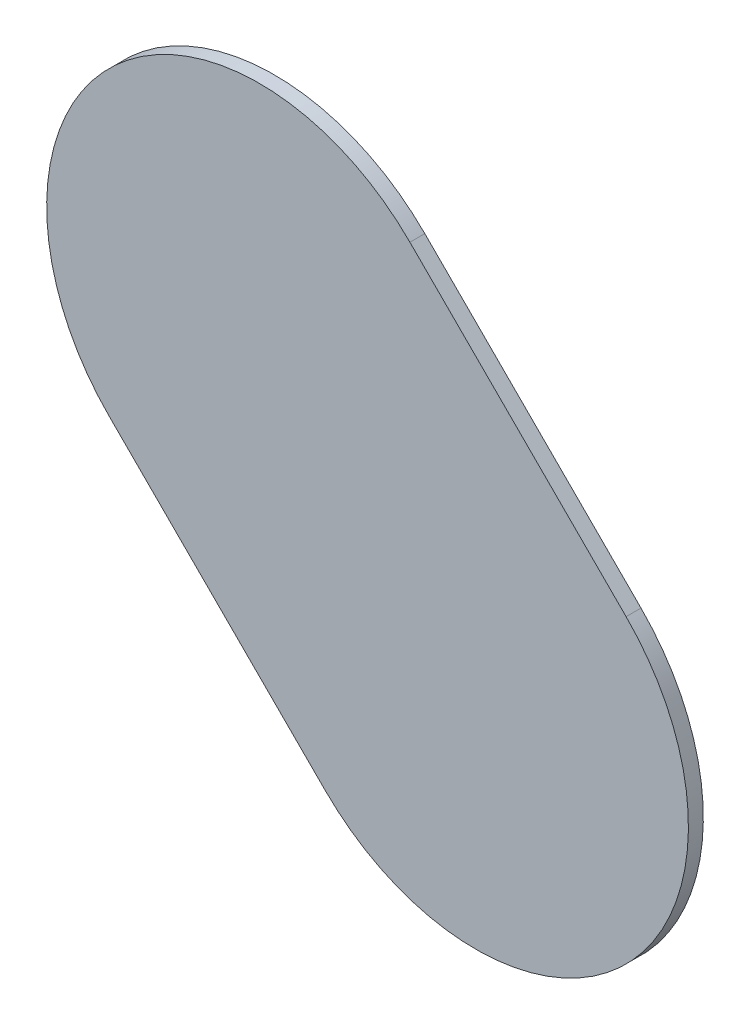
ISO-10303-21;
HEADER;
FILE_DESCRIPTION(('STEP AP214'),'2;1');
FILE_NAME('part.step','',(''),(''),'','','');
FILE_SCHEMA(('AUTOMOTIVE_DESIGN { 1 0 10303 214 1 1 1 1 }'));
ENDSEC;
DATA;
#1=APPLICATION_CONTEXT('core data for automotive mechanical design processes');
#2=APPLICATION_PROTOCOL_DEFINITION('international standard','automotive_design',2000,#1);
#3=PRODUCT_CONTEXT('',#1,'mechanical');
#4=PRODUCT('Part','Part','',(#3));
#5=PRODUCT_RELATED_PRODUCT_CATEGORY('part','',(#4));
#6=PRODUCT_DEFINITION_FORMATION('','',#4);
#7=PRODUCT_DEFINITION_CONTEXT('part definition',#1,'design');
#8=PRODUCT_DEFINITION('design','',#6,#7);
#9=PRODUCT_DEFINITION_SHAPE('','',#8);
#10=(LENGTH_UNIT() NAMED_UNIT(*) SI_UNIT(.MILLI.,.METRE.));
#11=(NAMED_UNIT(*) PLANE_ANGLE_UNIT() SI_UNIT($,.RADIAN.));
#12=(NAMED_UNIT(*) SI_UNIT($,.STERADIAN.) SOLID_ANGLE_UNIT());
#13=UNCERTAINTY_MEASURE_WITH_UNIT(LENGTH_MEASURE(1.E-05),#10,'distance_accuracy_value','');
#14=(GEOMETRIC_REPRESENTATION_CONTEXT(3) GLOBAL_UNCERTAINTY_ASSIGNED_CONTEXT((#13)) GLOBAL_UNIT_ASSIGNED_CONTEXT((#10,
#11,#12)) REPRESENTATION_CONTEXT('',''));
#15=CARTESIAN_POINT('',(0.,0.,0.));
#16=DIRECTION('',(0.,0.,1.));
#17=DIRECTION('',(1.,0.,0.));
#18=AXIS2_PLACEMENT_3D('',#15,#16,#17);
#19=CARTESIAN_POINT('',(155.293553,-145.442446,0.));
#20=DIRECTION('',(0.,0.,1.));
#21=DIRECTION('',(1.,0.,0.));
#22=AXIS2_PLACEMENT_3D('',#19,#20,#21);
#23=PLANE('',#22);
#24=DIRECTION('',(-0.707106781186548,0.707106781186548,0.));
#25=VECTOR('',#24,1.);
#26=CARTESIAN_POINT('',(155.293553,-145.442446,0.));
#27=LINE('',#26,#25);
#28=CARTESIAN_POINT('',(155.293553,-145.442446,0.));
#29=VERTEX_POINT('',#28);
#30=CARTESIAN_POINT('',(154.785553,-144.934446,0.));
#31=VERTEX_POINT('',#30);
#32=EDGE_CURVE('E92',#29,#31,#27,.T.);
#33=ORIENTED_EDGE('',*,*,#32,.T.);
#34=CARTESIAN_POINT('',(154.4319995,-145.2879995,0.));
#35=DIRECTION('',(0.,0.,1.));
#36=DIRECTION('',(0.707106781186548,0.707106781186548,0.));
#37=AXIS2_PLACEMENT_3D('',#34,#35,#36);
#38=CIRCLE('',#37,0.500000154724);
#39=CARTESIAN_POINT('',(154.078446,-145.641553,0.));
#40=VERTEX_POINT('',#39);
#41=EDGE_CURVE('E87',#31,#40,#38,.T.);
#42=ORIENTED_EDGE('',*,*,#41,.T.);
#43=DIRECTION('',(0.707106781186548,-0.707106781186548,0.));
#44=VECTOR('',#43,1.);
#45=CARTESIAN_POINT('',(154.078446,-145.641553,0.));
#46=LINE('',#45,#44);
#47=CARTESIAN_POINT('',(154.586446,-146.149553,0.));
#48=VERTEX_POINT('',#47);
#49=EDGE_CURVE('E104',#40,#48,#46,.T.);
#50=ORIENTED_EDGE('',*,*,#49,.T.);
#51=CARTESIAN_POINT('',(154.9399995,-145.7959995,0.));
#52=DIRECTION('',(0.,0.,1.));
#53=DIRECTION('',(-0.707106781186548,-0.707106781186548,0.));
#54=AXIS2_PLACEMENT_3D('',#51,#52,#53);
#55=CIRCLE('',#54,0.500000154724);
#56=EDGE_CURVE('E11',#48,#29,#55,.T.);
#57=ORIENTED_EDGE('',*,*,#56,.T.);
#58=EDGE_LOOP('',(#33,#42,#50,#57));
#59=FACE_BOUND('',#58,.T.);
#60=ADVANCED_FACE('F17',(#59),#23,.T.);
#61=CARTESIAN_POINT('',(155.293553,-145.442446,-0.035));
#62=DIRECTION('',(0.,0.,1.));
#63=DIRECTION('',(1.,0.,0.));
#64=AXIS2_PLACEMENT_3D('',#61,#62,#63);
#65=PLANE('',#64);
#66=CARTESIAN_POINT('',(154.9399995,-145.7959995,-0.035));
#67=DIRECTION('',(0.,0.,1.));
#68=DIRECTION('',(-0.707106781186548,-0.707106781186548,0.));
#69=AXIS2_PLACEMENT_3D('',#66,#67,#68);
#70=CIRCLE('',#69,0.500000154724);
#71=CARTESIAN_POINT('',(154.586446,-146.149553,-0.035));
#72=VERTEX_POINT('',#71);
#73=CARTESIAN_POINT('',(155.293553,-145.442446,-0.035));
#74=VERTEX_POINT('',#73);
#75=EDGE_CURVE('E26',#72,#74,#70,.T.);
#76=ORIENTED_EDGE('',*,*,#75,.F.);
#77=DIRECTION('',(0.707106781186548,-0.707106781186548,0.));
#78=VECTOR('',#77,1.);
#79=CARTESIAN_POINT('',(154.078446,-145.641553,-0.035));
#80=LINE('',#79,#78);
#81=CARTESIAN_POINT('',(154.078446,-145.641553,-0.035));
#82=VERTEX_POINT('',#81);
#83=EDGE_CURVE('E75',#82,#72,#80,.T.);
#84=ORIENTED_EDGE('',*,*,#83,.F.);
#85=CARTESIAN_POINT('',(154.4319995,-145.2879995,-0.035));
#86=DIRECTION('',(0.,0.,1.));
#87=DIRECTION('',(0.707106781186548,0.707106781186548,0.));
#88=AXIS2_PLACEMENT_3D('',#85,#86,#87);
#89=CIRCLE('',#88,0.500000154724);
#90=CARTESIAN_POINT('',(154.785553,-144.934446,-0.035));
#91=VERTEX_POINT('',#90);
#92=EDGE_CURVE('E69',#91,#82,#89,.T.);
#93=ORIENTED_EDGE('',*,*,#92,.F.);
#94=DIRECTION('',(-0.707106781186548,0.707106781186548,0.));
#95=VECTOR('',#94,1.);
#96=CARTESIAN_POINT('',(155.293553,-145.442446,-0.035));
#97=LINE('',#96,#95);
#98=EDGE_CURVE('E73',#74,#91,#97,.T.);
#99=ORIENTED_EDGE('',*,*,#98,.F.);
#100=EDGE_LOOP('',(#76,#84,#93,#99));
#101=FACE_BOUND('',#100,.T.);
#102=ADVANCED_FACE('F71',(#101),#65,.F.);
#103=CARTESIAN_POINT('',(154.9399995,-145.7959995,-0.035));
#104=DIRECTION('',(0.,0.,-1.));
#105=DIRECTION('',(-0.707106781186548,-0.707106781186548,0.));
#106=AXIS2_PLACEMENT_3D('',#103,#104,#105);
#107=CYLINDRICAL_SURFACE('',#106,0.500000154724);
#108=ORIENTED_EDGE('',*,*,#75,.T.);
#109=DIRECTION('',(0.,0.,1.));
#110=VECTOR('',#109,1.);
#111=CARTESIAN_POINT('',(155.293553,-145.442446,-0.035));
#112=LINE('',#111,#110);
#113=EDGE_CURVE('E81',#74,#29,#112,.T.);
#114=ORIENTED_EDGE('',*,*,#113,.T.);
#115=ORIENTED_EDGE('',*,*,#56,.F.);
#116=DIRECTION('',(0.,0.,1.));
#117=VECTOR('',#116,1.);
#118=CARTESIAN_POINT('',(154.586446,-146.149553,-0.035));
#119=LINE('',#118,#117);
#120=EDGE_CURVE('E20',#72,#48,#119,.T.);
#121=ORIENTED_EDGE('',*,*,#120,.F.);
#122=EDGE_LOOP('',(#108,#114,#115,#121));
#123=FACE_BOUND('',#122,.T.);
#124=ADVANCED_FACE('F123',(#123),#107,.T.);
#125=CARTESIAN_POINT('',(154.078446,-145.641553,-0.035));
#126=DIRECTION('',(0.707106781186548,0.707106781186548,0.));
#127=DIRECTION('',(0.,0.,-1.));
#128=AXIS2_PLACEMENT_3D('',#125,#126,#127);
#129=PLANE('',#128);
#130=ORIENTED_EDGE('',*,*,#83,.T.);
#131=ORIENTED_EDGE('',*,*,#120,.T.);
#132=ORIENTED_EDGE('',*,*,#49,.F.);
#133=DIRECTION('',(0.,0.,1.));
#134=VECTOR('',#133,1.);
#135=CARTESIAN_POINT('',(154.078446,-145.641553,-0.035));
#136=LINE('',#135,#134);
#137=EDGE_CURVE('E80',#82,#40,#136,.T.);
#138=ORIENTED_EDGE('',*,*,#137,.F.);
#139=EDGE_LOOP('',(#130,#131,#132,#138));
#140=FACE_BOUND('',#139,.T.);
#141=ADVANCED_FACE('F122',(#140),#129,.F.);
#142=CARTESIAN_POINT('',(154.4319995,-145.2879995,-0.035));
#143=DIRECTION('',(0.,0.,-1.));
#144=DIRECTION('',(0.707106781186548,0.707106781186548,0.));
#145=AXIS2_PLACEMENT_3D('',#142,#143,#144);
#146=CYLINDRICAL_SURFACE('',#145,0.500000154724);
#147=ORIENTED_EDGE('',*,*,#92,.T.);
#148=ORIENTED_EDGE('',*,*,#137,.T.);
#149=ORIENTED_EDGE('',*,*,#41,.F.);
#150=DIRECTION('',(0.,0.,1.));
#151=VECTOR('',#150,1.);
#152=CARTESIAN_POINT('',(154.785553,-144.934446,-0.035));
#153=LINE('',#152,#151);
#154=EDGE_CURVE('E84',#91,#31,#153,.T.);
#155=ORIENTED_EDGE('',*,*,#154,.F.);
#156=EDGE_LOOP('',(#147,#148,#149,#155));
#157=FACE_BOUND('',#156,.T.);
#158=ADVANCED_FACE('F85',(#157),#146,.T.);
#159=CARTESIAN_POINT('',(155.293553,-145.442446,-0.035));
#160=DIRECTION('',(-0.707106781186548,-0.707106781186548,0.));
#161=DIRECTION('',(-0.707106781186548,0.707106781186548,0.));
#162=AXIS2_PLACEMENT_3D('',#159,#160,#161);
#163=PLANE('',#162);
#164=ORIENTED_EDGE('',*,*,#98,.T.);
#165=ORIENTED_EDGE('',*,*,#154,.T.);
#166=ORIENTED_EDGE('',*,*,#32,.F.);
#167=ORIENTED_EDGE('',*,*,#113,.F.);
#168=EDGE_LOOP('',(#164,#165,#166,#167));
#169=FACE_BOUND('',#168,.T.);
#170=ADVANCED_FACE('F95',(#169),#163,.F.);
#171=CLOSED_SHELL('',(#60,#102,#124,#141,#158,#170));
#172=MANIFOLD_SOLID_BREP('B1',#171);
#173=ADVANCED_BREP_SHAPE_REPRESENTATION('',(#18,#172),#14);
#174=SHAPE_DEFINITION_REPRESENTATION(#9,#173);
ENDSEC;
END-ISO-10303-21;
